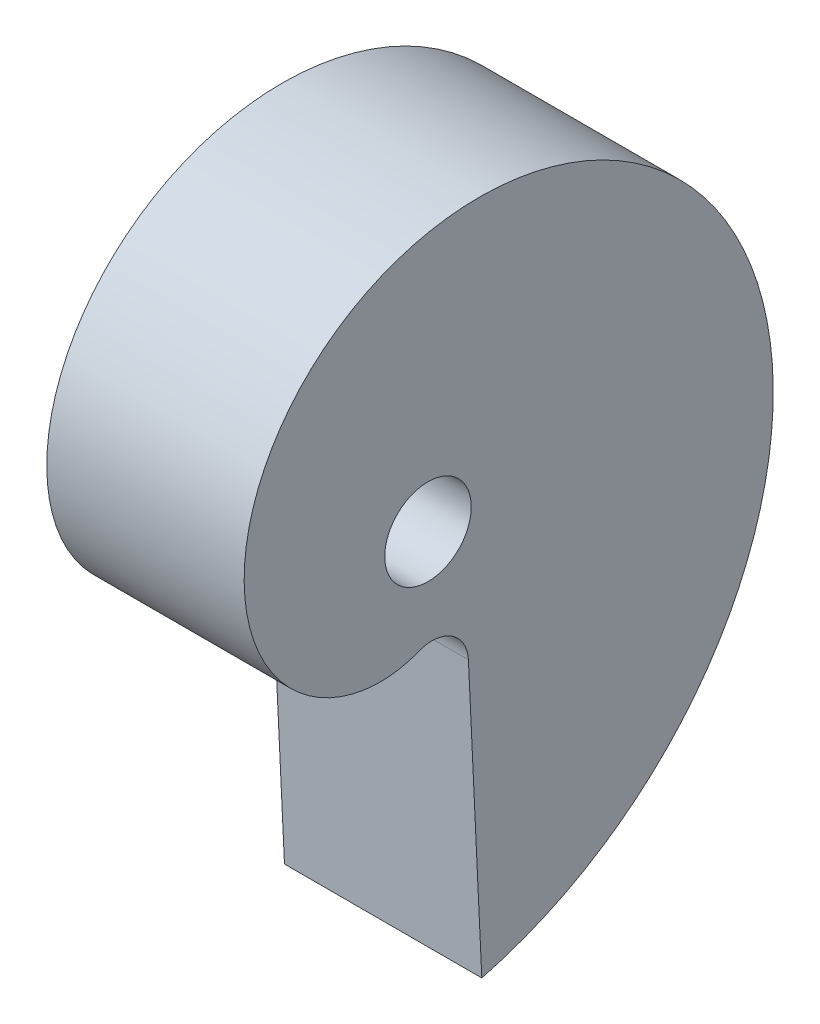
ISO-10303-21;
HEADER;
FILE_DESCRIPTION(('STEP AP214'),'2;1');
FILE_NAME('part.step','',(''),(''),'','','');
FILE_SCHEMA(('AUTOMOTIVE_DESIGN { 1 0 10303 214 1 1 1 1 }'));
ENDSEC;
DATA;
#1=APPLICATION_CONTEXT('core data for automotive mechanical design processes');
#2=APPLICATION_PROTOCOL_DEFINITION('international standard','automotive_design',2000,#1);
#3=PRODUCT_CONTEXT('',#1,'mechanical');
#4=PRODUCT('Part','Part','',(#3));
#5=PRODUCT_RELATED_PRODUCT_CATEGORY('part','',(#4));
#6=PRODUCT_DEFINITION_FORMATION('','',#4);
#7=PRODUCT_DEFINITION_CONTEXT('part definition',#1,'design');
#8=PRODUCT_DEFINITION('design','',#6,#7);
#9=PRODUCT_DEFINITION_SHAPE('','',#8);
#10=(LENGTH_UNIT() NAMED_UNIT(*) SI_UNIT(.MILLI.,.METRE.));
#11=(NAMED_UNIT(*) PLANE_ANGLE_UNIT() SI_UNIT($,.RADIAN.));
#12=(NAMED_UNIT(*) SI_UNIT($,.STERADIAN.) SOLID_ANGLE_UNIT());
#13=UNCERTAINTY_MEASURE_WITH_UNIT(LENGTH_MEASURE(1.E-05),#10,'distance_accuracy_value','');
#14=(GEOMETRIC_REPRESENTATION_CONTEXT(3) GLOBAL_UNCERTAINTY_ASSIGNED_CONTEXT((#13)) GLOBAL_UNIT_ASSIGNED_CONTEXT((#10,
#11,#12)) REPRESENTATION_CONTEXT('',''));
#15=CARTESIAN_POINT('',(0.,0.,0.));
#16=DIRECTION('',(0.,0.,1.));
#17=DIRECTION('',(1.,0.,0.));
#18=AXIS2_PLACEMENT_3D('',#15,#16,#17);
#19=CARTESIAN_POINT('',(12.7,16.3980040897592,0.208936694079273));
#20=DIRECTION('',(1.,0.,0.));
#21=DIRECTION('',(0.,0.,-1.));
#22=AXIS2_PLACEMENT_3D('',#19,#20,#21);
#23=PLANE('',#22);
#24=CARTESIAN_POINT('',(12.7,-26.6041786448891,-3.46411616806894));
#25=CARTESIAN_POINT('',(12.7,-26.5960990181453,-3.49393067135354));
#26=CARTESIAN_POINT('',(12.7,-26.5880156349324,-3.52374410868873));
#27=CARTESIAN_POINT('',(12.7,-26.5718488325451,-3.58337111594988));
#28=CARTESIAN_POINT('',(12.7,-26.5637654133707,-3.61318468587584));
#29=CARTESIAN_POINT('',(12.7,-26.5395261439436,-3.70262963202641));
#30=CARTESIAN_POINT('',(12.7,-26.5233815637382,-3.76226420628094));
#31=CARTESIAN_POINT('',(12.7,-26.4906236526863,-3.88140637873935));
#32=CARTESIAN_POINT('',(12.7,-26.4740103112024,-3.94091397402874));
#33=CARTESIAN_POINT('',(12.7,-26.4403815894244,-4.05981460436438));
#34=CARTESIAN_POINT('',(12.7,-26.4233662121929,-4.11920764027957));
#35=CARTESIAN_POINT('',(12.7,-26.3716923994657,-4.29720938115184));
#36=CARTESIAN_POINT('',(12.7,-26.3364072843143,-4.41563707917067));
#37=CARTESIAN_POINT('',(12.7,-26.2641853845529,-4.6519850599258));
#38=CARTESIAN_POINT('',(12.7,-26.2272486119225,-4.76990534633561));
#39=CARTESIAN_POINT('',(12.7,-26.1139444068046,-5.12293103285834));
#40=CARTESIAN_POINT('',(12.7,-26.0350986002427,-5.35724781947172));
#41=CARTESIAN_POINT('',(12.7,-25.8708563849999,-5.8235592949556));
#42=CARTESIAN_POINT('',(12.7,-25.7854600420231,-6.05555400709093));
#43=CARTESIAN_POINT('',(12.7,-25.5195003139906,-6.74780898379338));
#44=CARTESIAN_POINT('',(12.7,-25.3291595386374,-7.20436094526831));
#45=CARTESIAN_POINT('',(12.7,-24.9225212871115,-8.10647878886224));
#46=CARTESIAN_POINT('',(12.7,-24.7061887301483,-8.55202882213988));
#47=CARTESIAN_POINT('',(12.7,-24.2482870811777,-9.42992884621023));
#48=CARTESIAN_POINT('',(12.7,-24.0067199993427,-9.86227988488946));
#49=CARTESIAN_POINT('',(12.7,-23.499035484093,-10.7123263424163));
#50=CARTESIAN_POINT('',(12.7,-23.2329186005125,-11.1300220892049));
#51=CARTESIAN_POINT('',(12.7,-22.7456402479494,-11.847851602567));
#52=CARTESIAN_POINT('',(12.7,-22.5296437628228,-12.1515056315926));
#53=CARTESIAN_POINT('',(12.7,-22.084413352748,-12.7489932481006));
#54=CARTESIAN_POINT('',(12.7,-21.8551785466971,-13.0428261798607));
#55=CARTESIAN_POINT('',(12.7,-21.3838895241104,-13.620035602395));
#56=CARTESIAN_POINT('',(12.7,-21.141834989919,-13.9034118337705));
#57=CARTESIAN_POINT('',(12.7,-20.6453436861472,-14.4590921821359));
#58=CARTESIAN_POINT('',(12.7,-20.3909071208197,-14.7313964816312));
#59=CARTESIAN_POINT('',(12.7,-19.870311136869,-15.2640889646824));
#60=CARTESIAN_POINT('',(12.7,-19.6041625900917,-15.5244877601765));
#61=CARTESIAN_POINT('',(12.7,-19.0603866610495,-16.0329689554833));
#62=CARTESIAN_POINT('',(12.7,-18.7827592318886,-16.2810513049693));
#63=CARTESIAN_POINT('',(12.7,-17.933432481453,-17.0059312611249));
#64=CARTESIAN_POINT('',(12.7,-17.3451183982972,-17.4635361757599));
#65=CARTESIAN_POINT('',(12.7,-16.1647015449857,-18.2976613403723));
#66=CARTESIAN_POINT('',(12.7,-15.5748340735074,-18.6773591195821));
#67=CARTESIAN_POINT('',(12.7,-14.3640301688315,-19.3835613476243));
#68=CARTESIAN_POINT('',(12.7,-13.7430946848625,-19.7100674203402));
#69=CARTESIAN_POINT('',(12.7,-12.4747331278291,-20.3069368781326));
#70=CARTESIAN_POINT('',(12.7,-11.8273052792346,-20.5772964928467));
#71=CARTESIAN_POINT('',(12.7,-10.5107649849682,-21.0586719994844));
#72=CARTESIAN_POINT('',(12.7,-9.84165333182641,-21.2696900575841));
#73=CARTESIAN_POINT('',(12.7,-8.51931603069606,-21.6215571855532));
#74=CARTESIAN_POINT('',(12.7,-7.86685786047716,-21.7652761257472));
#75=CARTESIAN_POINT('',(12.7,-6.88075589921008,-21.9374607449297));
#76=CARTESIAN_POINT('',(12.7,-6.55078378350999,-21.9876263623933));
#77=CARTESIAN_POINT('',(12.7,-5.88895381514913,-22.0733163220885));
#78=CARTESIAN_POINT('',(12.7,-5.55709595067515,-22.1088405724972));
#79=CARTESIAN_POINT('',(12.7,-4.55979382082403,-22.1932365925857));
#80=CARTESIAN_POINT('',(12.7,-3.89228024143644,-22.2199912172447));
#81=CARTESIAN_POINT('',(12.7,-2.89152295014816,-22.2149934639596));
#82=CARTESIAN_POINT('',(12.7,-2.55798556615433,-22.2058023918767));
#83=CARTESIAN_POINT('',(12.7,-1.89167446294591,-22.1722723503277));
#84=CARTESIAN_POINT('',(12.7,-1.55890073697784,-22.1479335153446));
#85=CARTESIAN_POINT('',(12.7,-0.595715786563489,-22.0553379817985));
#86=CARTESIAN_POINT('',(12.7,0.0329519082644807,-21.9672696384117));
#87=CARTESIAN_POINT('',(12.7,0.968090394017084,-21.7940847068843));
#88=CARTESIAN_POINT('',(12.7,1.27852595277456,-21.7295000942686));
#89=CARTESIAN_POINT('',(12.7,1.89622303880414,-21.5866153495594));
#90=CARTESIAN_POINT('',(12.7,2.20348455851135,-21.5083151847848));
#91=CARTESIAN_POINT('',(12.7,3.11949232688065,-21.2529876735919));
#92=CARTESIAN_POINT('',(12.7,3.72272393447467,-21.0554848603221));
#93=CARTESIAN_POINT('',(12.7,4.61211008989112,-20.7191477551366));
#94=CARTESIAN_POINT('',(12.7,4.90602590174425,-20.600340041007));
#95=CARTESIAN_POINT('',(12.7,5.48814338740102,-20.3494332944114));
#96=CARTESIAN_POINT('',(12.7,5.77634502116379,-20.2173341688482));
#97=CARTESIAN_POINT('',(12.7,6.60155511822596,-19.8159032003133));
#98=CARTESIAN_POINT('',(12.7,7.13040589307388,-19.5295564938876));
#99=CARTESIAN_POINT('',(12.7,8.16081793802565,-18.9114937344462));
#100=CARTESIAN_POINT('',(12.7,8.66238000700598,-18.5797790105786));
#101=CARTESIAN_POINT('',(12.7,9.63370323518806,-17.8727976579963));
#102=CARTESIAN_POINT('',(12.7,10.1034706650373,-17.4975396568974));
#103=CARTESIAN_POINT('',(12.7,11.0071094740781,-16.7060538785788));
#104=CARTESIAN_POINT('',(12.7,11.4409836517707,-16.2898293009652));
#105=CARTESIAN_POINT('',(12.7,12.2455901724637,-15.4431512610323));
#106=CARTESIAN_POINT('',(12.7,12.6184856964032,-15.0147506322602));
#107=CARTESIAN_POINT('',(12.7,13.3251088370727,-14.1266556784948));
#108=CARTESIAN_POINT('',(12.7,13.658837644674,-13.6669623056353));
#109=CARTESIAN_POINT('',(12.7,14.1273347711691,-12.9565066966575));
#110=CARTESIAN_POINT('',(12.7,14.2781567865579,-12.7161917146737));
#111=CARTESIAN_POINT('',(12.7,14.5687526701808,-12.2289769415579));
#112=CARTESIAN_POINT('',(12.7,14.7085275622432,-11.982077763481));
#113=CARTESIAN_POINT('',(12.7,14.976662087067,-11.4822081934086));
#114=CARTESIAN_POINT('',(12.7,15.1050233906383,-11.2292386969412));
#115=CARTESIAN_POINT('',(12.7,15.3500337253178,-10.7175936099666));
#116=CARTESIAN_POINT('',(12.7,15.4666792251924,-10.4589163275719));
#117=CARTESIAN_POINT('',(12.7,15.6813212851905,-9.95180679999024));
#118=CARTESIAN_POINT('',(12.7,15.7800115945683,-9.70366850500394));
#119=CARTESIAN_POINT('',(12.7,15.9663531695722,-9.2032821883138));
#120=CARTESIAN_POINT('',(12.7,16.0540033918904,-8.95103378073715));
#121=CARTESIAN_POINT('',(12.7,16.3000334282841,-8.18886243094257));
#122=CARTESIAN_POINT('',(12.7,16.4415695943575,-7.67333168162063));
#123=CARTESIAN_POINT('',(12.7,16.6185812659381,-6.89232214687901));
#124=CARTESIAN_POINT('',(12.7,16.6717037530089,-6.63069488211353));
#125=CARTESIAN_POINT('',(12.7,16.7659669980484,-6.10528997868587));
#126=CARTESIAN_POINT('',(12.7,16.8071076371406,-5.84151231871546));
#127=CARTESIAN_POINT('',(12.7,16.9123052056012,-5.04776388346588));
#128=CARTESIAN_POINT('',(12.7,16.9581756794004,-4.5152108565262));
#129=CARTESIAN_POINT('',(12.7,16.9889866131176,-3.73188497077908));
#130=CARTESIAN_POINT('',(12.7,16.9933497523758,-3.48170479371437));
#131=CARTESIAN_POINT('',(12.7,16.9910077767209,-2.98139125909959));
#132=CARTESIAN_POINT('',(12.7,16.9843028337307,-2.73125790088262));
#133=CARTESIAN_POINT('',(12.7,16.9474771512814,-1.98170896838924));
#134=CARTESIAN_POINT('',(12.7,16.9006509706288,-1.48300889884048));
#135=CARTESIAN_POINT('',(12.7,16.7621449217171,-0.492050969980706));
#136=CARTESIAN_POINT('',(12.7,16.6704764254929,0.00020849019213582));
#137=CARTESIAN_POINT('',(12.7,16.4420525322467,0.974178631913562));
#138=CARTESIAN_POINT('',(12.7,16.3052998467292,1.45588994600308));
#139=CARTESIAN_POINT('',(12.7,15.9979016234245,2.37265974437791));
#140=CARTESIAN_POINT('',(12.7,15.8301329655558,2.80868423790338));
#141=CARTESIAN_POINT('',(12.7,15.4562265829443,3.66397859957526));
#142=CARTESIAN_POINT('',(12.7,15.2500901712971,4.08324904051499));
#143=CARTESIAN_POINT('',(12.7,14.8006581322923,4.90125114980656));
#144=CARTESIAN_POINT('',(12.7,14.5573729209783,5.29998853358491));
#145=CARTESIAN_POINT('',(12.7,14.0347805079883,6.07310185409697));
#146=CARTESIAN_POINT('',(12.7,13.7554758700731,6.44747952183559));
#147=CARTESIAN_POINT('',(12.7,13.1839183924489,7.14235925341812));
#148=CARTESIAN_POINT('',(12.7,12.8940275022432,7.46479955466107));
#149=CARTESIAN_POINT('',(12.7,12.4384424571224,7.92791034063023));
#150=CARTESIAN_POINT('',(12.7,12.2831032441109,8.07887213844365));
#151=CARTESIAN_POINT('',(12.7,11.9657286963515,8.37357323403963));
#152=CARTESIAN_POINT('',(12.7,11.8036933306129,8.51731249838838));
#153=CARTESIAN_POINT('',(12.7,11.3080343569058,8.93710093457745));
#154=CARTESIAN_POINT('',(12.7,10.9646916643919,9.20188991072441));
#155=CARTESIAN_POINT('',(12.7,10.4324327389453,9.57404235832414));
#156=CARTESIAN_POINT('',(12.7,10.2521216010789,9.69393119674056));
#157=CARTESIAN_POINT('',(12.7,9.88598424193469,9.92497549292142));
#158=CARTESIAN_POINT('',(12.7,9.70015816748061,10.0361311829009));
#159=CARTESIAN_POINT('',(12.7,9.16444116405589,10.3393060660077));
#160=CARTESIAN_POINT('',(12.7,8.80832915226598,10.5204801836729));
#161=CARTESIAN_POINT('',(12.7,8.08132908197637,10.8501433844362));
#162=CARTESIAN_POINT('',(12.7,7.71044060320731,10.9986315371016));
#163=CARTESIAN_POINT('',(12.7,6.95664104338392,11.2610276657326));
#164=CARTESIAN_POINT('',(12.7,6.57373373578024,11.3749463776861));
#165=CARTESIAN_POINT('',(12.7,5.99273470026,11.5183452851603));
#166=CARTESIAN_POINT('',(12.7,5.7979496332391,11.5615669025186));
#167=CARTESIAN_POINT('',(12.7,5.40652321008225,11.6385618313836));
#168=CARTESIAN_POINT('',(12.7,5.20988190770239,11.6723354156404));
#169=CARTESIAN_POINT('',(12.7,4.65033370171099,11.7544105230111));
#170=CARTESIAN_POINT('',(12.7,4.28568497206795,11.7912985181493));
#171=CARTESIAN_POINT('',(12.7,3.55455013605828,11.8318701835188));
#172=CARTESIAN_POINT('',(12.7,3.18806390085958,11.8355514920303));
#173=CARTESIAN_POINT('',(12.7,2.45641583932739,11.8090174666788));
#174=CARTESIAN_POINT('',(12.7,2.09125359671678,11.778813920978));
#175=CARTESIAN_POINT('',(12.7,1.36548059192559,11.6838082483825));
#176=CARTESIAN_POINT('',(12.7,1.00486887674723,11.6190134931392));
#177=CARTESIAN_POINT('',(12.7,0.324307942849594,11.4614382628748));
#178=CARTESIAN_POINT('',(12.7,0.00364406995611465,11.3717401093354));
#179=CARTESIAN_POINT('',(12.7,-0.628147099321365,11.1632867552544));
#180=CARTESIAN_POINT('',(12.7,-0.939273778376596,11.044529678221));
#181=CARTESIAN_POINT('',(12.7,-1.54892201894779,10.7784921512198));
#182=CARTESIAN_POINT('',(12.7,-1.84744907693349,10.6312242987931));
#183=CARTESIAN_POINT('',(12.7,-2.42897758776261,10.3086185913174));
#184=CARTESIAN_POINT('',(12.7,-2.71198222110295,10.1332865156067));
#185=CARTESIAN_POINT('',(12.7,-3.10837977647508,9.85924255327324));
#186=CARTESIAN_POINT('',(12.7,-3.22942542142978,9.77144787341416));
#187=CARTESIAN_POINT('',(12.7,-3.46732952151261,9.59036048217526));
#188=CARTESIAN_POINT('',(12.7,-3.58418806355643,9.4970678850274));
#189=CARTESIAN_POINT('',(12.7,-3.92806004067557,9.20918027089204));
#190=CARTESIAN_POINT('',(12.7,-4.14842759657389,9.00653556116692));
#191=CARTESIAN_POINT('',(12.7,-4.56878919503829,8.58138333255455));
#192=CARTESIAN_POINT('',(12.7,-4.76879483064123,8.35888725296908));
#193=CARTESIAN_POINT('',(12.7,-5.14614206186432,7.89543066389403));
#194=CARTESIAN_POINT('',(12.7,-5.3234875023102,7.65447329791619));
#195=CARTESIAN_POINT('',(12.7,-5.63430947780914,7.18366218799663));
#196=CARTESIAN_POINT('',(12.7,-5.77047423090025,6.95558248768723));
#197=CARTESIAN_POINT('',(12.7,-6.02062257579595,6.48754083821427));
#198=CARTESIAN_POINT('',(12.7,-6.1346071224693,6.24757940112347));
#199=CARTESIAN_POINT('',(12.7,-6.33887912149973,5.75777155134351));
#200=CARTESIAN_POINT('',(12.7,-6.42916767621237,5.50792559911196));
#201=CARTESIAN_POINT('',(12.7,-6.58443349235139,5.00049357965073));
#202=CARTESIAN_POINT('',(12.7,-6.64941442335705,4.74290864040478));
#203=CARTESIAN_POINT('',(12.7,-6.74598736460804,4.25449797920384));
#204=CARTESIAN_POINT('',(12.7,-6.780711824222,4.02429629283166));
#205=CARTESIAN_POINT('',(12.7,-6.81617319998053,3.67733736076881));
#206=CARTESIAN_POINT('',(12.7,-6.82522288289698,3.56139077828091));
#207=CARTESIAN_POINT('',(12.7,-6.83763420983804,3.32919441165276));
#208=CARTESIAN_POINT('',(12.7,-6.84099580829413,3.21294462509094));
#209=CARTESIAN_POINT('',(12.7,-6.84242850832694,2.86488965539435));
#210=CARTESIAN_POINT('',(12.7,-6.83192934168472,2.6329862272909));
#211=CARTESIAN_POINT('',(12.7,-6.78738287473666,2.17159674221351));
#212=CARTESIAN_POINT('',(12.7,-6.75335040877215,1.94210925480276));
#213=CARTESIAN_POINT('',(12.7,-6.66928060603601,1.52806566622524));
#214=CARTESIAN_POINT('',(12.7,-6.62312313736352,1.34272156396831));
#215=CARTESIAN_POINT('',(12.7,-6.51402688183936,0.977073180265552));
#216=CARTESIAN_POINT('',(12.7,-6.45108967798272,0.796768425181119));
#217=CARTESIAN_POINT('',(12.7,-6.37955418312461,0.619822850888123));
#218=B_SPLINE_CURVE_WITH_KNOTS('',3,(#24,#25,#26,#27,#28,#29,#30,#31,#32,#33,#34,#35,#36,#37,
#38,#39,#40,#41,#42,#43,#44,#45,#46,#47,#48,#49,#50,#51,#52,#53,#54,#55,#56,#57,#58,#59,#60,#61,
#62,#63,#64,#65,#66,#67,#68,#69,#70,#71,#72,#73,#74,#75,#76,#77,#78,#79,#80,#81,#82,#83,#84,#85,
#86,#87,#88,#89,#90,#91,#92,#93,#94,#95,#96,#97,#98,#99,#100,#101,#102,#103,#104,#105,#106,#107,
#108,#109,#110,#111,#112,#113,#114,#115,#116,#117,#118,#119,#120,#121,#122,#123,#124,#125,#126,
#127,#128,#129,#130,#131,#132,#133,#134,#135,#136,#137,#138,#139,#140,#141,#142,#143,#144,#145,
#146,#147,#148,#149,#150,#151,#152,#153,#154,#155,#156,#157,#158,#159,#160,#161,#162,#163,#164,
#165,#166,#167,#168,#169,#170,#171,#172,#173,#174,#175,#176,#177,#178,#179,#180,#181,#182,#183,
#184,#185,#186,#187,#188,#189,#190,#191,#192,#193,#194,#195,#196,#197,#198,#199,#200,#201,#202,
#203,#204,#205,#206,#207,#208,#209,#210,#211,#212,#213,#214,#215,#216,#217),.UNSPECIFIED.,.F.,
.F.,(4,2,2,2,2,2,2,2,2,2,2,2,2,2,2,2,2,2,2,2,2,2,2,2,2,2,2,2,2,2,2,2,2,2,2,2,2,2,2,2,2,2,2,2,2,
2,2,2,2,2,2,2,2,2,2,2,2,2,2,2,2,2,2,2,2,2,2,2,2,2,2,2,2,2,2,2,2,2,2,2,2,2,2,2,2,2,2,2,2,2,2,2,2,
2,2,2,4),(0.,0.0926695617352574,0.185339535614265,0.370682711215113,0.556030096112552,
0.741376069577325,1.1120793414309,1.48277992497415,2.2243479758606,2.96590858953527,
4.44896419863202,5.93404444342148,7.41900647738353,8.90393526118761,10.0215131922545,
11.1391655918504,12.2568456983469,13.3745073739483,14.4911525872986,15.6078023630403,
17.8403733209062,19.942329574827,22.0442216463401,24.1462548190774,26.2482112502258,
28.2497809593054,29.2507798930136,30.2517851043673,32.2527611602103,33.2534722057809,
34.2541743670945,36.1557427204534,37.1067331856918,38.0577259169634,39.9589143278495,
40.9097121227251,41.8605165777567,43.6622308050559,45.4638922587852,47.265197340965,
49.0663618475696,50.7681276305578,52.4698416576219,53.3207700719231,54.1716195309475,
55.0223442302499,55.8733245798795,56.6741831513156,57.475117348612,59.0763957503357,
59.8770662248953,60.6777446429507,62.2785901719909,63.0290553534382,63.7795088778617,
65.2800101467939,66.7801310849274,68.2801618175425,69.6799153349475,71.0796209560827,
72.4789348360549,73.8781491717417,75.1771008636637,75.8267289281718,76.4763599995956,
77.7749132133461,78.4243090869169,79.0736876871546,80.2706163235864,81.4675790271636,
82.6641696171176,83.2625396804237,83.860892467929,84.9588208120137,86.0568272421415,
87.154451806521,88.2518425520269,89.2493967940745,90.2470154706009,91.2441943493013,
92.24116813994,92.6896317930356,93.1380861315428,94.0347850469901,94.9309705386994,
95.8270037693383,96.622784174215,97.418530312772,98.2142394260493,99.009833119334,
99.7071699333863,100.055943118078,100.404719096858,101.099890942744,101.794624982317,
102.366866921723,102.939054895092),.UNSPECIFIED.);
#219=CARTESIAN_POINT('',(12.7,-26.6041786448891,-3.46411616806894));
#220=VERTEX_POINT('',#219);
#221=CARTESIAN_POINT('',(12.7,-6.37955418312461,0.619822850888123));
#222=VERTEX_POINT('',#221);
#223=EDGE_CURVE('E116',#220,#222,#218,.T.);
#224=ORIENTED_EDGE('',*,*,#223,.T.);
#225=CARTESIAN_POINT('',(12.7,-8.55278837318837,-0.259188983321581));
#226=DIRECTION('',(1.,0.,0.));
#227=DIRECTION('',(0.,0.,-1.));
#228=AXIS2_PLACEMENT_3D('',#225,#226,#227);
#229=CIRCLE('',#228,2.34427145389411);
#230=CARTESIAN_POINT('',(12.7,-8.44148736532646,-2.60081677936256));
#231=VERTEX_POINT('',#230);
#232=EDGE_CURVE('E38',#222,#231,#229,.F.);
#233=ORIENTED_EDGE('',*,*,#232,.T.);
#234=DIRECTION('',(0.,-0.998872290216758,-0.0474778668131734));
#235=VECTOR('',#234,1.);
#236=CARTESIAN_POINT('',(12.7,-26.3357339713737,-3.45135659852166));
#237=LINE('',#236,#235);
#238=EDGE_CURVE('E52',#231,#220,#237,.T.);
#239=ORIENTED_EDGE('',*,*,#238,.T.);
#240=EDGE_LOOP('',(#224,#233,#239));
#241=FACE_BOUND('',#240,.T.);
#242=CARTESIAN_POINT('',(12.7,0.,0.));
#243=DIRECTION('',(1.,0.,0.));
#244=DIRECTION('',(0.,0.,-1.));
#245=AXIS2_PLACEMENT_3D('',#242,#243,#244);
#246=CIRCLE('',#245,2.7841);
#247=CARTESIAN_POINT('',(12.7,0.,-2.7841));
#248=VERTEX_POINT('',#247);
#249=EDGE_CURVE('E85',#248,#248,#246,.T.);
#250=ORIENTED_EDGE('',*,*,#249,.F.);
#251=EDGE_LOOP('',(#250));
#252=FACE_BOUND('',#251,.T.);
#253=ADVANCED_FACE('F34',(#241,#252),#23,.T.);
#254=CARTESIAN_POINT('',(0.,16.3980040897592,0.208936694079273));
#255=DIRECTION('',(1.,0.,0.));
#256=DIRECTION('',(0.,0.,-1.));
#257=AXIS2_PLACEMENT_3D('',#254,#255,#256);
#258=PLANE('',#257);
#259=CARTESIAN_POINT('',(0.,-26.6041786448891,-3.46411616806894));
#260=CARTESIAN_POINT('',(0.,-26.5960990181453,-3.49393067135354));
#261=CARTESIAN_POINT('',(0.,-26.5880156349324,-3.52374410868873));
#262=CARTESIAN_POINT('',(0.,-26.5718488325451,-3.58337111594988));
#263=CARTESIAN_POINT('',(0.,-26.5637654133707,-3.61318468587584));
#264=CARTESIAN_POINT('',(0.,-26.5395261439436,-3.70262963202641));
#265=CARTESIAN_POINT('',(0.,-26.5233815637382,-3.76226420628094));
#266=CARTESIAN_POINT('',(0.,-26.4906236526863,-3.88140637873935));
#267=CARTESIAN_POINT('',(0.,-26.4740103112024,-3.94091397402874));
#268=CARTESIAN_POINT('',(0.,-26.4403815894244,-4.05981460436438));
#269=CARTESIAN_POINT('',(0.,-26.4233662121929,-4.11920764027957));
#270=CARTESIAN_POINT('',(0.,-26.3716923994657,-4.29720938115184));
#271=CARTESIAN_POINT('',(0.,-26.3364072843143,-4.41563707917067));
#272=CARTESIAN_POINT('',(0.,-26.2641853845529,-4.6519850599258));
#273=CARTESIAN_POINT('',(0.,-26.2272486119225,-4.76990534633561));
#274=CARTESIAN_POINT('',(0.,-26.1139444068046,-5.12293103285834));
#275=CARTESIAN_POINT('',(0.,-26.0350986002427,-5.35724781947172));
#276=CARTESIAN_POINT('',(0.,-25.8708563849999,-5.8235592949556));
#277=CARTESIAN_POINT('',(0.,-25.7854600420231,-6.05555400709093));
#278=CARTESIAN_POINT('',(0.,-25.5195003139906,-6.74780898379338));
#279=CARTESIAN_POINT('',(0.,-25.3291595386374,-7.20436094526831));
#280=CARTESIAN_POINT('',(0.,-24.9225212871115,-8.10647878886224));
#281=CARTESIAN_POINT('',(0.,-24.7061887301483,-8.55202882213988));
#282=CARTESIAN_POINT('',(0.,-24.2482870811777,-9.42992884621023));
#283=CARTESIAN_POINT('',(0.,-24.0067199993427,-9.86227988488946));
#284=CARTESIAN_POINT('',(0.,-23.499035484093,-10.7123263424163));
#285=CARTESIAN_POINT('',(0.,-23.2329186005125,-11.1300220892049));
#286=CARTESIAN_POINT('',(0.,-22.7456402479494,-11.847851602567));
#287=CARTESIAN_POINT('',(0.,-22.5296437628228,-12.1515056315926));
#288=CARTESIAN_POINT('',(0.,-22.084413352748,-12.7489932481006));
#289=CARTESIAN_POINT('',(0.,-21.8551785466971,-13.0428261798607));
#290=CARTESIAN_POINT('',(0.,-21.3838895241104,-13.620035602395));
#291=CARTESIAN_POINT('',(0.,-21.141834989919,-13.9034118337705));
#292=CARTESIAN_POINT('',(0.,-20.6453436861472,-14.4590921821359));
#293=CARTESIAN_POINT('',(0.,-20.3909071208197,-14.7313964816312));
#294=CARTESIAN_POINT('',(0.,-19.870311136869,-15.2640889646824));
#295=CARTESIAN_POINT('',(0.,-19.6041625900917,-15.5244877601765));
#296=CARTESIAN_POINT('',(0.,-19.0603866610495,-16.0329689554833));
#297=CARTESIAN_POINT('',(0.,-18.7827592318886,-16.2810513049693));
#298=CARTESIAN_POINT('',(0.,-17.933432481453,-17.0059312611249));
#299=CARTESIAN_POINT('',(0.,-17.3451183982972,-17.4635361757599));
#300=CARTESIAN_POINT('',(0.,-16.1647015449857,-18.2976613403723));
#301=CARTESIAN_POINT('',(0.,-15.5748340735074,-18.6773591195821));
#302=CARTESIAN_POINT('',(0.,-14.3640301688315,-19.3835613476243));
#303=CARTESIAN_POINT('',(0.,-13.7430946848625,-19.7100674203402));
#304=CARTESIAN_POINT('',(0.,-12.4747331278291,-20.3069368781326));
#305=CARTESIAN_POINT('',(0.,-11.8273052792346,-20.5772964928467));
#306=CARTESIAN_POINT('',(0.,-10.5107649849682,-21.0586719994844));
#307=CARTESIAN_POINT('',(0.,-9.84165333182641,-21.2696900575841));
#308=CARTESIAN_POINT('',(0.,-8.51931603069606,-21.6215571855532));
#309=CARTESIAN_POINT('',(0.,-7.86685786047716,-21.7652761257472));
#310=CARTESIAN_POINT('',(0.,-6.88075589921008,-21.9374607449297));
#311=CARTESIAN_POINT('',(0.,-6.55078378350999,-21.9876263623933));
#312=CARTESIAN_POINT('',(0.,-5.88895381514913,-22.0733163220885));
#313=CARTESIAN_POINT('',(0.,-5.55709595067515,-22.1088405724972));
#314=CARTESIAN_POINT('',(0.,-4.55979382082403,-22.1932365925857));
#315=CARTESIAN_POINT('',(0.,-3.89228024143644,-22.2199912172447));
#316=CARTESIAN_POINT('',(0.,-2.89152295014816,-22.2149934639596));
#317=CARTESIAN_POINT('',(0.,-2.55798556615433,-22.2058023918767));
#318=CARTESIAN_POINT('',(0.,-1.89167446294591,-22.1722723503277));
#319=CARTESIAN_POINT('',(0.,-1.55890073697784,-22.1479335153446));
#320=CARTESIAN_POINT('',(0.,-0.595715786563489,-22.0553379817985));
#321=CARTESIAN_POINT('',(0.,0.0329519082644807,-21.9672696384117));
#322=CARTESIAN_POINT('',(0.,0.968090394017084,-21.7940847068843));
#323=CARTESIAN_POINT('',(0.,1.27852595277456,-21.7295000942686));
#324=CARTESIAN_POINT('',(0.,1.89622303880414,-21.5866153495594));
#325=CARTESIAN_POINT('',(0.,2.20348455851135,-21.5083151847848));
#326=CARTESIAN_POINT('',(0.,3.11949232688065,-21.2529876735919));
#327=CARTESIAN_POINT('',(0.,3.72272393447467,-21.0554848603221));
#328=CARTESIAN_POINT('',(0.,4.61211008989112,-20.7191477551366));
#329=CARTESIAN_POINT('',(0.,4.90602590174425,-20.600340041007));
#330=CARTESIAN_POINT('',(0.,5.48814338740102,-20.3494332944114));
#331=CARTESIAN_POINT('',(0.,5.77634502116379,-20.2173341688482));
#332=CARTESIAN_POINT('',(0.,6.60155511822596,-19.8159032003133));
#333=CARTESIAN_POINT('',(0.,7.13040589307388,-19.5295564938876));
#334=CARTESIAN_POINT('',(0.,8.16081793802565,-18.9114937344462));
#335=CARTESIAN_POINT('',(0.,8.66238000700598,-18.5797790105786));
#336=CARTESIAN_POINT('',(0.,9.63370323518806,-17.8727976579963));
#337=CARTESIAN_POINT('',(0.,10.1034706650373,-17.4975396568974));
#338=CARTESIAN_POINT('',(0.,11.0071094740781,-16.7060538785788));
#339=CARTESIAN_POINT('',(0.,11.4409836517707,-16.2898293009652));
#340=CARTESIAN_POINT('',(0.,12.2455901724637,-15.4431512610323));
#341=CARTESIAN_POINT('',(0.,12.6184856964032,-15.0147506322602));
#342=CARTESIAN_POINT('',(0.,13.3251088370727,-14.1266556784948));
#343=CARTESIAN_POINT('',(0.,13.658837644674,-13.6669623056353));
#344=CARTESIAN_POINT('',(0.,14.1273347711691,-12.9565066966575));
#345=CARTESIAN_POINT('',(0.,14.2781567865579,-12.7161917146737));
#346=CARTESIAN_POINT('',(0.,14.5687526701808,-12.2289769415579));
#347=CARTESIAN_POINT('',(0.,14.7085275622432,-11.982077763481));
#348=CARTESIAN_POINT('',(0.,14.976662087067,-11.4822081934086));
#349=CARTESIAN_POINT('',(0.,15.1050233906383,-11.2292386969412));
#350=CARTESIAN_POINT('',(0.,15.3500337253178,-10.7175936099666));
#351=CARTESIAN_POINT('',(0.,15.4666792251924,-10.4589163275719));
#352=CARTESIAN_POINT('',(0.,15.6813212851905,-9.95180679999024));
#353=CARTESIAN_POINT('',(0.,15.7800115945683,-9.70366850500394));
#354=CARTESIAN_POINT('',(0.,15.9663531695722,-9.2032821883138));
#355=CARTESIAN_POINT('',(0.,16.0540033918904,-8.95103378073715));
#356=CARTESIAN_POINT('',(0.,16.3000334282841,-8.18886243094257));
#357=CARTESIAN_POINT('',(0.,16.4415695943575,-7.67333168162063));
#358=CARTESIAN_POINT('',(0.,16.6185812659381,-6.89232214687901));
#359=CARTESIAN_POINT('',(0.,16.6717037530089,-6.63069488211353));
#360=CARTESIAN_POINT('',(0.,16.7659669980484,-6.10528997868587));
#361=CARTESIAN_POINT('',(0.,16.8071076371406,-5.84151231871546));
#362=CARTESIAN_POINT('',(0.,16.9123052056012,-5.04776388346588));
#363=CARTESIAN_POINT('',(0.,16.9581756794004,-4.5152108565262));
#364=CARTESIAN_POINT('',(0.,16.9889866131176,-3.73188497077908));
#365=CARTESIAN_POINT('',(0.,16.9933497523758,-3.48170479371437));
#366=CARTESIAN_POINT('',(0.,16.9910077767209,-2.98139125909959));
#367=CARTESIAN_POINT('',(0.,16.9843028337307,-2.73125790088262));
#368=CARTESIAN_POINT('',(0.,16.9474771512814,-1.98170896838924));
#369=CARTESIAN_POINT('',(0.,16.9006509706288,-1.48300889884048));
#370=CARTESIAN_POINT('',(0.,16.7621449217171,-0.492050969980706));
#371=CARTESIAN_POINT('',(0.,16.6704764254929,0.00020849019213582));
#372=CARTESIAN_POINT('',(0.,16.4420525322467,0.974178631913562));
#373=CARTESIAN_POINT('',(0.,16.3052998467292,1.45588994600308));
#374=CARTESIAN_POINT('',(0.,15.9979016234245,2.37265974437791));
#375=CARTESIAN_POINT('',(0.,15.8301329655558,2.80868423790338));
#376=CARTESIAN_POINT('',(0.,15.4562265829443,3.66397859957526));
#377=CARTESIAN_POINT('',(0.,15.2500901712971,4.08324904051499));
#378=CARTESIAN_POINT('',(0.,14.8006581322923,4.90125114980656));
#379=CARTESIAN_POINT('',(0.,14.5573729209783,5.29998853358491));
#380=CARTESIAN_POINT('',(0.,14.0347805079883,6.07310185409697));
#381=CARTESIAN_POINT('',(0.,13.7554758700731,6.44747952183559));
#382=CARTESIAN_POINT('',(0.,13.1839183924489,7.14235925341812));
#383=CARTESIAN_POINT('',(0.,12.8940275022432,7.46479955466107));
#384=CARTESIAN_POINT('',(0.,12.4384424571224,7.92791034063023));
#385=CARTESIAN_POINT('',(0.,12.2831032441109,8.07887213844365));
#386=CARTESIAN_POINT('',(0.,11.9657286963515,8.37357323403963));
#387=CARTESIAN_POINT('',(0.,11.8036933306129,8.51731249838838));
#388=CARTESIAN_POINT('',(0.,11.3080343569058,8.93710093457745));
#389=CARTESIAN_POINT('',(0.,10.9646916643919,9.20188991072441));
#390=CARTESIAN_POINT('',(0.,10.4324327389453,9.57404235832414));
#391=CARTESIAN_POINT('',(0.,10.2521216010789,9.69393119674056));
#392=CARTESIAN_POINT('',(0.,9.88598424193469,9.92497549292142));
#393=CARTESIAN_POINT('',(0.,9.70015816748061,10.0361311829009));
#394=CARTESIAN_POINT('',(0.,9.16444116405589,10.3393060660077));
#395=CARTESIAN_POINT('',(0.,8.80832915226598,10.5204801836729));
#396=CARTESIAN_POINT('',(0.,8.08132908197637,10.8501433844362));
#397=CARTESIAN_POINT('',(0.,7.71044060320731,10.9986315371016));
#398=CARTESIAN_POINT('',(0.,6.95664104338392,11.2610276657326));
#399=CARTESIAN_POINT('',(0.,6.57373373578024,11.3749463776861));
#400=CARTESIAN_POINT('',(0.,5.99273470026,11.5183452851603));
#401=CARTESIAN_POINT('',(0.,5.7979496332391,11.5615669025186));
#402=CARTESIAN_POINT('',(0.,5.40652321008225,11.6385618313836));
#403=CARTESIAN_POINT('',(0.,5.20988190770239,11.6723354156404));
#404=CARTESIAN_POINT('',(0.,4.65033370171099,11.7544105230111));
#405=CARTESIAN_POINT('',(0.,4.28568497206795,11.7912985181493));
#406=CARTESIAN_POINT('',(0.,3.55455013605828,11.8318701835188));
#407=CARTESIAN_POINT('',(0.,3.18806390085958,11.8355514920303));
#408=CARTESIAN_POINT('',(0.,2.45641583932739,11.8090174666788));
#409=CARTESIAN_POINT('',(0.,2.09125359671678,11.778813920978));
#410=CARTESIAN_POINT('',(0.,1.36548059192559,11.6838082483825));
#411=CARTESIAN_POINT('',(0.,1.00486887674723,11.6190134931392));
#412=CARTESIAN_POINT('',(0.,0.324307942849594,11.4614382628748));
#413=CARTESIAN_POINT('',(0.,0.00364406995611465,11.3717401093354));
#414=CARTESIAN_POINT('',(0.,-0.628147099321365,11.1632867552544));
#415=CARTESIAN_POINT('',(0.,-0.939273778376596,11.044529678221));
#416=CARTESIAN_POINT('',(0.,-1.54892201894779,10.7784921512198));
#417=CARTESIAN_POINT('',(0.,-1.84744907693349,10.6312242987931));
#418=CARTESIAN_POINT('',(0.,-2.42897758776261,10.3086185913174));
#419=CARTESIAN_POINT('',(0.,-2.71198222110295,10.1332865156067));
#420=CARTESIAN_POINT('',(0.,-3.10837977647508,9.85924255327324));
#421=CARTESIAN_POINT('',(0.,-3.22942542142978,9.77144787341416));
#422=CARTESIAN_POINT('',(0.,-3.46732952151261,9.59036048217526));
#423=CARTESIAN_POINT('',(0.,-3.58418806355643,9.4970678850274));
#424=CARTESIAN_POINT('',(0.,-3.92806004067557,9.20918027089204));
#425=CARTESIAN_POINT('',(0.,-4.14842759657389,9.00653556116692));
#426=CARTESIAN_POINT('',(0.,-4.56878919503829,8.58138333255455));
#427=CARTESIAN_POINT('',(0.,-4.76879483064123,8.35888725296908));
#428=CARTESIAN_POINT('',(0.,-5.14614206186432,7.89543066389403));
#429=CARTESIAN_POINT('',(0.,-5.3234875023102,7.65447329791619));
#430=CARTESIAN_POINT('',(0.,-5.63430947780914,7.18366218799663));
#431=CARTESIAN_POINT('',(0.,-5.77047423090025,6.95558248768723));
#432=CARTESIAN_POINT('',(0.,-6.02062257579595,6.48754083821427));
#433=CARTESIAN_POINT('',(0.,-6.1346071224693,6.24757940112347));
#434=CARTESIAN_POINT('',(0.,-6.33887912149973,5.75777155134351));
#435=CARTESIAN_POINT('',(0.,-6.42916767621237,5.50792559911196));
#436=CARTESIAN_POINT('',(0.,-6.58443349235139,5.00049357965073));
#437=CARTESIAN_POINT('',(0.,-6.64941442335705,4.74290864040478));
#438=CARTESIAN_POINT('',(0.,-6.74598736460804,4.25449797920384));
#439=CARTESIAN_POINT('',(0.,-6.780711824222,4.02429629283166));
#440=CARTESIAN_POINT('',(0.,-6.81617319998053,3.67733736076881));
#441=CARTESIAN_POINT('',(0.,-6.82522288289698,3.56139077828091));
#442=CARTESIAN_POINT('',(0.,-6.83763420983804,3.32919441165276));
#443=CARTESIAN_POINT('',(0.,-6.84099580829413,3.21294462509094));
#444=CARTESIAN_POINT('',(0.,-6.84242850832694,2.86488965539435));
#445=CARTESIAN_POINT('',(0.,-6.83192934168472,2.6329862272909));
#446=CARTESIAN_POINT('',(0.,-6.78738287473666,2.17159674221351));
#447=CARTESIAN_POINT('',(0.,-6.75335040877215,1.94210925480276));
#448=CARTESIAN_POINT('',(0.,-6.66928060603601,1.52806566622524));
#449=CARTESIAN_POINT('',(0.,-6.62312313736352,1.34272156396831));
#450=CARTESIAN_POINT('',(0.,-6.51402688183936,0.977073180265552));
#451=CARTESIAN_POINT('',(0.,-6.45108967798272,0.796768425181119));
#452=CARTESIAN_POINT('',(0.,-6.37955418312461,0.619822850888123));
#453=B_SPLINE_CURVE_WITH_KNOTS('',3,(#259,#260,#261,#262,#263,#264,#265,#266,#267,#268,#269,
#270,#271,#272,#273,#274,#275,#276,#277,#278,#279,#280,#281,#282,#283,#284,#285,#286,#287,#288,
#289,#290,#291,#292,#293,#294,#295,#296,#297,#298,#299,#300,#301,#302,#303,#304,#305,#306,#307,
#308,#309,#310,#311,#312,#313,#314,#315,#316,#317,#318,#319,#320,#321,#322,#323,#324,#325,#326,
#327,#328,#329,#330,#331,#332,#333,#334,#335,#336,#337,#338,#339,#340,#341,#342,#343,#344,#345,
#346,#347,#348,#349,#350,#351,#352,#353,#354,#355,#356,#357,#358,#359,#360,#361,#362,#363,#364,
#365,#366,#367,#368,#369,#370,#371,#372,#373,#374,#375,#376,#377,#378,#379,#380,#381,#382,#383,
#384,#385,#386,#387,#388,#389,#390,#391,#392,#393,#394,#395,#396,#397,#398,#399,#400,#401,#402,
#403,#404,#405,#406,#407,#408,#409,#410,#411,#412,#413,#414,#415,#416,#417,#418,#419,#420,#421,
#422,#423,#424,#425,#426,#427,#428,#429,#430,#431,#432,#433,#434,#435,#436,#437,#438,#439,#440,
#441,#442,#443,#444,#445,#446,#447,#448,#449,#450,#451,#452),.UNSPECIFIED.,.F.,.F.,(4,2,2,2,2,2,
2,2,2,2,2,2,2,2,2,2,2,2,2,2,2,2,2,2,2,2,2,2,2,2,2,2,2,2,2,2,2,2,2,2,2,2,2,2,2,2,2,2,2,2,2,2,2,2,
2,2,2,2,2,2,2,2,2,2,2,2,2,2,2,2,2,2,2,2,2,2,2,2,2,2,2,2,2,2,2,2,2,2,2,2,2,2,2,2,2,2,4),(0.,
0.0926695617352574,0.185339535614265,0.370682711215113,0.556030096112552,0.741376069577325,
1.1120793414309,1.48277992497415,2.2243479758606,2.96590858953527,4.44896419863202,
5.93404444342148,7.41900647738353,8.90393526118761,10.0215131922545,11.1391655918504,
12.2568456983469,13.3745073739483,14.4911525872986,15.6078023630403,17.8403733209062,
19.942329574827,22.0442216463401,24.1462548190774,26.2482112502258,28.2497809593054,
29.2507798930136,30.2517851043673,32.2527611602103,33.2534722057809,34.2541743670945,
36.1557427204534,37.1067331856918,38.0577259169634,39.9589143278495,40.9097121227251,
41.8605165777567,43.6622308050559,45.4638922587852,47.265197340965,49.0663618475696,
50.7681276305578,52.4698416576219,53.3207700719231,54.1716195309475,55.0223442302499,
55.8733245798795,56.6741831513156,57.475117348612,59.0763957503357,59.8770662248953,
60.6777446429507,62.2785901719909,63.0290553534382,63.7795088778617,65.2800101467939,
66.7801310849274,68.2801618175425,69.6799153349475,71.0796209560827,72.4789348360549,
73.8781491717417,75.1771008636637,75.8267289281718,76.4763599995956,77.7749132133461,
78.4243090869169,79.0736876871546,80.2706163235864,81.4675790271636,82.6641696171176,
83.2625396804237,83.860892467929,84.9588208120137,86.0568272421415,87.154451806521,
88.2518425520269,89.2493967940745,90.2470154706009,91.2441943493013,92.24116813994,
92.6896317930356,93.1380861315428,94.0347850469901,94.9309705386994,95.8270037693383,
96.622784174215,97.418530312772,98.2142394260493,99.009833119334,99.7071699333863,
100.055943118078,100.404719096858,101.099890942744,101.794624982317,102.366866921723,
102.939054895092),.UNSPECIFIED.);
#454=CARTESIAN_POINT('',(0.,-26.6041786448891,-3.46411616806894));
#455=VERTEX_POINT('',#454);
#456=CARTESIAN_POINT('',(0.,-6.37955418312461,0.619822850888123));
#457=VERTEX_POINT('',#456);
#458=EDGE_CURVE('E78',#455,#457,#453,.T.);
#459=ORIENTED_EDGE('',*,*,#458,.F.);
#460=DIRECTION('',(0.,-0.998872290216758,-0.0474778668131734));
#461=VECTOR('',#460,1.);
#462=CARTESIAN_POINT('',(0.,-26.3357339713737,-3.45135659852166));
#463=LINE('',#462,#461);
#464=CARTESIAN_POINT('',(0.,-8.44148736532646,-2.60081677936256));
#465=VERTEX_POINT('',#464);
#466=EDGE_CURVE('E66',#465,#455,#463,.T.);
#467=ORIENTED_EDGE('',*,*,#466,.F.);
#468=CARTESIAN_POINT('',(0.,-8.55278837318837,-0.259188983321581));
#469=DIRECTION('',(1.,0.,0.));
#470=DIRECTION('',(0.,0.,-1.));
#471=AXIS2_PLACEMENT_3D('',#468,#469,#470);
#472=CIRCLE('',#471,2.34427145389411);
#473=EDGE_CURVE('E72',#457,#465,#472,.F.);
#474=ORIENTED_EDGE('',*,*,#473,.F.);
#475=EDGE_LOOP('',(#459,#467,#474));
#476=FACE_BOUND('',#475,.T.);
#477=CARTESIAN_POINT('',(0.,0.,0.));
#478=DIRECTION('',(1.,0.,0.));
#479=DIRECTION('',(0.,0.,-1.));
#480=AXIS2_PLACEMENT_3D('',#477,#478,#479);
#481=CIRCLE('',#480,2.7841);
#482=CARTESIAN_POINT('',(0.,0.,-2.7841));
#483=VERTEX_POINT('',#482);
#484=EDGE_CURVE('E88',#483,#483,#481,.T.);
#485=ORIENTED_EDGE('',*,*,#484,.T.);
#486=EDGE_LOOP('',(#485));
#487=FACE_BOUND('',#486,.T.);
#488=ADVANCED_FACE('F75',(#476,#487),#258,.F.);
#489=CARTESIAN_POINT('',(12.7,-26.7483319063098,-2.10718755279176));
#490=CARTESIAN_POINT('',(12.7,-26.6073824375161,-2.62712941052099));
#491=CARTESIAN_POINT('',(12.7,-26.4664329687224,-3.14707126825022));
#492=CARTESIAN_POINT('',(12.7,-25.8850164099486,-5.29183143138332));
#493=CARTESIAN_POINT('',(12.7,-25.2937709802203,-6.85500985861185));
#494=CARTESIAN_POINT('',(12.7,-23.8451939849136,-9.80629411018198));
#495=CARTESIAN_POINT('',(12.7,-22.9879265697091,-11.1943493778112));
#496=CARTESIAN_POINT('',(12.7,-21.0514010056648,-13.7523524342122));
#497=CARTESIAN_POINT('',(12.7,-19.9722145165317,-14.9222640436458));
#498=CARTESIAN_POINT('',(12.7,-17.6424148443339,-17.0111362692066));
#499=CARTESIAN_POINT('',(12.7,-16.3918777440894,-17.9300760548234));
#500=CARTESIAN_POINT('',(12.7,-13.774181132005,-19.4952108297215));
#501=CARTESIAN_POINT('',(12.7,-12.4070989510175,-20.1414006679111));
#502=CARTESIAN_POINT('',(12.7,-9.61304301680638,-21.1506818581234));
#503=CARTESIAN_POINT('',(12.7,-8.18614470800054,-21.5137834309209));
#504=CARTESIAN_POINT('',(12.7,-5.3288100875924,-21.9578966574969));
#505=CARTESIAN_POINT('',(12.7,-3.8984443651538,-22.038932986476));
#506=CARTESIAN_POINT('',(12.7,-1.08794928189315,-21.9307589450492));
#507=CARTESIAN_POINT('',(12.7,0.292117032528461,-21.7415862291151));
#508=CARTESIAN_POINT('',(12.7,2.95283289615589,-21.1147307327981));
#509=CARTESIAN_POINT('',(12.7,4.23342924609723,-20.6770966268396));
#510=CARTESIAN_POINT('',(12.7,6.65237105198453,-19.5836453555955));
#511=CARTESIAN_POINT('',(12.7,7.79067499289227,-18.9278855327687));
#512=CARTESIAN_POINT('',(12.7,9.88997156551444,-17.4355003933537));
#513=CARTESIAN_POINT('',(12.7,10.8509356728284,-16.5989384482919));
#514=CARTESIAN_POINT('',(12.7,12.5693210600784,-14.7874359048066));
#515=CARTESIAN_POINT('',(12.7,13.3267275415238,-13.8125618959728));
#516=CARTESIAN_POINT('',(12.7,14.6212472227952,-11.7701307863269));
#517=CARTESIAN_POINT('',(12.7,15.1583594978757,-10.7026406297588));
#518=CARTESIAN_POINT('',(12.7,16.0052572395325,-8.52186727257846));
#519=CARTESIAN_POINT('',(12.7,16.3150552236039,-7.40864857435838));
#520=CARTESIAN_POINT('',(12.7,16.7098316537026,-5.1825201174866));
#521=CARTESIAN_POINT('',(12.7,16.7948350803545,-4.06966980389498));
#522=CARTESIAN_POINT('',(12.7,16.7515036458065,-1.88772278855217));
#523=CARTESIAN_POINT('',(12.7,16.6232047553048,-0.818678144435623));
#524=CARTESIAN_POINT('',(12.7,16.1728034242135,1.23655153259428));
#525=CARTESIAN_POINT('',(12.7,15.8507460504129,2.22269384951727));
#526=CARTESIAN_POINT('',(12.7,15.0391926205608,4.07878041726697));
#527=CARTESIAN_POINT('',(12.7,14.5497485015278,4.94869279896394));
#528=CARTESIAN_POINT('',(12.7,13.4351525169527,6.5458728071125));
#529=CARTESIAN_POINT('',(12.7,12.8100570020662,7.27312041446994));
#530=CARTESIAN_POINT('',(12.7,11.4596211058448,8.56619770795014));
#531=CARTESIAN_POINT('',(12.7,10.7343389103516,9.13201969506656));
#532=CARTESIAN_POINT('',(12.7,8.46432492032774,10.5713349527582));
#533=CARTESIAN_POINT('',(12.7,6.82631034463374,11.1827796887629));
#534=CARTESIAN_POINT('',(12.7,3.59680348317033,11.7204279571445));
#535=CARTESIAN_POINT('',(12.7,2.00685947245538,11.6474809761802));
#536=CARTESIAN_POINT('',(12.7,-0.874358563474903,10.9424993264994));
#537=CARTESIAN_POINT('',(12.7,-2.16461256267651,10.3118298030999));
#538=CARTESIAN_POINT('',(12.7,-4.28109326467022,8.69840573541426));
#539=CARTESIAN_POINT('',(12.7,-5.10697539238301,7.71726162806799));
#540=CARTESIAN_POINT('',(12.7,-6.23707693613607,5.64499605846387));
#541=CARTESIAN_POINT('',(12.7,-6.54165034000696,4.55542957813348));
#542=CARTESIAN_POINT('',(12.7,-6.67904709626705,2.49487199667444));
#543=CARTESIAN_POINT('',(12.7,-6.51282232630776,1.52510200770759));
#544=CARTESIAN_POINT('',(12.7,-6.17940617515592,0.700777065763977));
#545=B_SPLINE_CURVE_WITH_KNOTS('',3,(#489,#490,#491,#492,#493,#494,#495,#496,#497,#498,#499,
#500,#501,#502,#503,#504,#505,#506,#507,#508,#509,#510,#511,#512,#513,#514,#515,#516,#517,#518,
#519,#520,#521,#522,#523,#524,#525,#526,#527,#528,#529,#530,#531,#532,#533,#534,#535,#536,#537,
#538,#539,#540,#541,#542,#543,#544),.UNSPECIFIED.,.F.,.F.,(4,2,2,2,2,2,2,2,2,2,2,2,2,2,2,2,2,2,
2,2,2,2,2,2,2,2,2,4),(-0.01,0.,0.0312500000000001,0.0625000000000001,0.0937500000000002,0.125,
0.15625,0.1875,0.218750000000001,0.250000000000001,0.281250000000001,0.312500000000001,
0.343750000000001,0.375000000000001,0.406250000000001,0.437500000000001,0.468750000000001,
0.500000000000001,0.53125,0.5625,0.59375,0.625,0.6875,0.75,0.8125,0.875,0.9375,1.),.UNSPECIFIED.);
#546=DIRECTION('',(-1.,0.,0.));
#547=VECTOR('',#546,1.);
#548=SURFACE_OF_LINEAR_EXTRUSION('',#545,#547);
#549=OFFSET_SURFACE('',#548,-0.2159,.F.);
#550=ORIENTED_EDGE('',*,*,#458,.T.);
#551=DIRECTION('',(-1.,0.,0.));
#552=VECTOR('',#551,1.);
#553=CARTESIAN_POINT('',(12.7,-6.37955418312461,0.619822850888123));
#554=LINE('',#553,#552);
#555=EDGE_CURVE('E12',#222,#457,#554,.T.);
#556=ORIENTED_EDGE('',*,*,#555,.F.);
#557=ORIENTED_EDGE('',*,*,#223,.F.);
#558=DIRECTION('',(-1.,0.,0.));
#559=VECTOR('',#558,1.);
#560=CARTESIAN_POINT('',(12.7,-26.6041786448891,-3.46411616806894));
#561=LINE('',#560,#559);
#562=EDGE_CURVE('E84',#220,#455,#561,.T.);
#563=ORIENTED_EDGE('',*,*,#562,.T.);
#564=EDGE_LOOP('',(#550,#556,#557,#563));
#565=FACE_BOUND('',#564,.T.);
#566=ADVANCED_FACE('F83',(#565),#549,.F.);
#567=CARTESIAN_POINT('',(12.7,-8.55278837318837,-0.259188983321581));
#568=DIRECTION('',(-1.,0.,0.));
#569=DIRECTION('',(0.,0.,1.));
#570=AXIS2_PLACEMENT_3D('',#567,#568,#569);
#571=CYLINDRICAL_SURFACE('',#570,2.34427145389411);
#572=ORIENTED_EDGE('',*,*,#473,.T.);
#573=DIRECTION('',(1.,0.,0.));
#574=VECTOR('',#573,1.);
#575=CARTESIAN_POINT('',(12.7,-8.44148736532646,-2.60081677936256));
#576=LINE('',#575,#574);
#577=EDGE_CURVE('E44',#231,#465,#576,.F.);
#578=ORIENTED_EDGE('',*,*,#577,.F.);
#579=ORIENTED_EDGE('',*,*,#232,.F.);
#580=ORIENTED_EDGE('',*,*,#555,.T.);
#581=EDGE_LOOP('',(#572,#578,#579,#580));
#582=FACE_BOUND('',#581,.T.);
#583=ADVANCED_FACE('F36',(#582),#571,.F.);
#584=CARTESIAN_POINT('',(12.7,-26.3357339713737,-3.45135659852166));
#585=DIRECTION('',(0.,0.0474778668131734,-0.998872290216758));
#586=DIRECTION('',(0.,0.998872290216758,0.0474778668131734));
#587=AXIS2_PLACEMENT_3D('',#584,#585,#586);
#588=PLANE('',#587);
#589=ORIENTED_EDGE('',*,*,#466,.T.);
#590=ORIENTED_EDGE('',*,*,#562,.F.);
#591=ORIENTED_EDGE('',*,*,#238,.F.);
#592=ORIENTED_EDGE('',*,*,#577,.T.);
#593=EDGE_LOOP('',(#589,#590,#591,#592));
#594=FACE_BOUND('',#593,.T.);
#595=ADVANCED_FACE('F121',(#594),#588,.F.);
#596=CARTESIAN_POINT('',(12.7,0.,0.));
#597=DIRECTION('',(-1.,0.,0.));
#598=DIRECTION('',(0.,0.,1.));
#599=AXIS2_PLACEMENT_3D('',#596,#597,#598);
#600=CYLINDRICAL_SURFACE('',#599,2.7841);
#601=ORIENTED_EDGE('',*,*,#249,.T.);
#602=EDGE_LOOP('',(#601));
#603=FACE_BOUND('',#602,.T.);
#604=ORIENTED_EDGE('',*,*,#484,.F.);
#605=EDGE_LOOP('',(#604));
#606=FACE_BOUND('',#605,.T.);
#607=ADVANCED_FACE('F123',(#603,#606),#600,.F.);
#608=CLOSED_SHELL('',(#253,#488,#566,#583,#595,#607));
#609=MANIFOLD_SOLID_BREP('B2',#608);
#610=ADVANCED_BREP_SHAPE_REPRESENTATION('',(#18,#609),#14);
#611=SHAPE_DEFINITION_REPRESENTATION(#9,#610);
ENDSEC;
END-ISO-10303-21;
